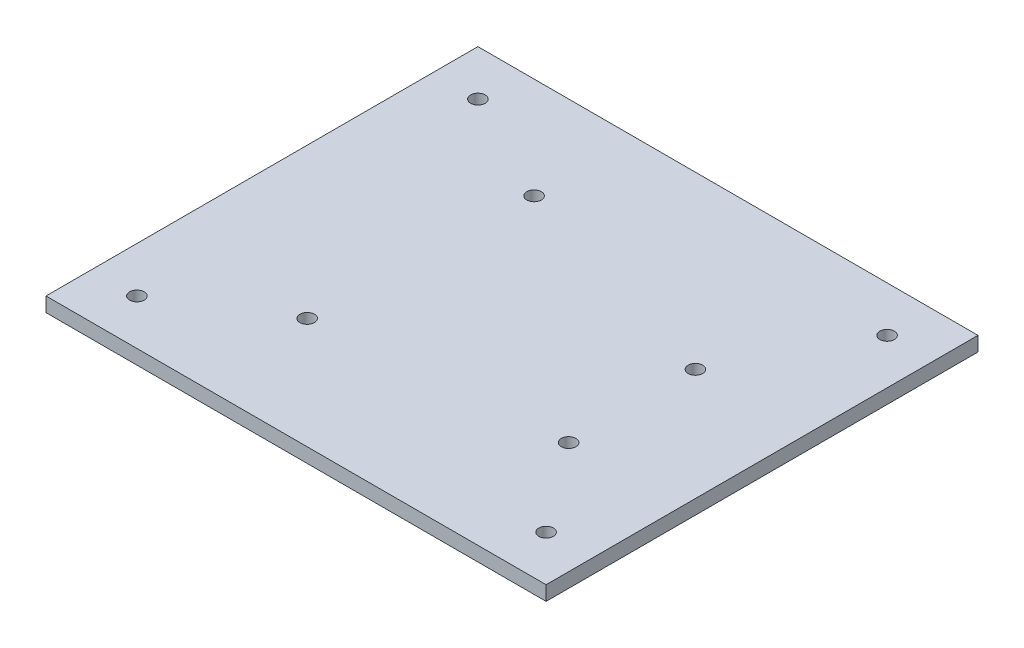
ISO-10303-21;
HEADER;
FILE_DESCRIPTION(('STEP AP214'),'2;1');
FILE_NAME('part.step','',(''),(''),'','','');
FILE_SCHEMA(('AUTOMOTIVE_DESIGN { 1 0 10303 214 1 1 1 1 }'));
ENDSEC;
DATA;
#1=APPLICATION_CONTEXT('core data for automotive mechanical design processes');
#2=APPLICATION_PROTOCOL_DEFINITION('international standard','automotive_design',2000,#1);
#3=PRODUCT_CONTEXT('',#1,'mechanical');
#4=PRODUCT('Part','Part','',(#3));
#5=PRODUCT_RELATED_PRODUCT_CATEGORY('part','',(#4));
#6=PRODUCT_DEFINITION_FORMATION('','',#4);
#7=PRODUCT_DEFINITION_CONTEXT('part definition',#1,'design');
#8=PRODUCT_DEFINITION('design','',#6,#7);
#9=PRODUCT_DEFINITION_SHAPE('','',#8);
#10=(LENGTH_UNIT() NAMED_UNIT(*) SI_UNIT(.MILLI.,.METRE.));
#11=(NAMED_UNIT(*) PLANE_ANGLE_UNIT() SI_UNIT($,.RADIAN.));
#12=(NAMED_UNIT(*) SI_UNIT($,.STERADIAN.) SOLID_ANGLE_UNIT());
#13=UNCERTAINTY_MEASURE_WITH_UNIT(LENGTH_MEASURE(1.E-05),#10,'distance_accuracy_value','');
#14=(GEOMETRIC_REPRESENTATION_CONTEXT(3) GLOBAL_UNCERTAINTY_ASSIGNED_CONTEXT((#13)) GLOBAL_UNIT_ASSIGNED_CONTEXT((#10,
#11,#12)) REPRESENTATION_CONTEXT('',''));
#15=CARTESIAN_POINT('',(0.,0.,0.));
#16=DIRECTION('',(0.,0.,1.));
#17=DIRECTION('',(1.,0.,0.));
#18=AXIS2_PLACEMENT_3D('',#15,#16,#17);
#19=CARTESIAN_POINT('',(0.,3.18,47.5));
#20=DIRECTION('',(0.,0.,-1.));
#21=DIRECTION('',(-1.,0.,0.));
#22=AXIS2_PLACEMENT_3D('',#19,#20,#21);
#23=PLANE('',#22);
#24=DIRECTION('',(1.,0.,0.));
#25=VECTOR('',#24,1.);
#26=CARTESIAN_POINT('',(0.,0.,47.5));
#27=LINE('',#26,#25);
#28=CARTESIAN_POINT('',(-55.,0.,47.5));
#29=VERTEX_POINT('',#28);
#30=CARTESIAN_POINT('',(55.,0.,47.5));
#31=VERTEX_POINT('',#30);
#32=EDGE_CURVE('E105',#29,#31,#27,.T.);
#33=ORIENTED_EDGE('',*,*,#32,.T.);
#34=DIRECTION('',(0.,-1.,0.));
#35=VECTOR('',#34,1.);
#36=CARTESIAN_POINT('',(55.,3.18,47.5));
#37=LINE('',#36,#35);
#38=CARTESIAN_POINT('',(55.,3.18,47.5));
#39=VERTEX_POINT('',#38);
#40=EDGE_CURVE('E11',#39,#31,#37,.T.);
#41=ORIENTED_EDGE('',*,*,#40,.F.);
#42=DIRECTION('',(1.,0.,0.));
#43=VECTOR('',#42,1.);
#44=CARTESIAN_POINT('',(0.,3.18,47.5));
#45=LINE('',#44,#43);
#46=CARTESIAN_POINT('',(-55.,3.18,47.5));
#47=VERTEX_POINT('',#46);
#48=EDGE_CURVE('E81',#47,#39,#45,.T.);
#49=ORIENTED_EDGE('',*,*,#48,.F.);
#50=DIRECTION('',(0.,-1.,0.));
#51=VECTOR('',#50,1.);
#52=CARTESIAN_POINT('',(-55.,3.18,47.5));
#53=LINE('',#52,#51);
#54=EDGE_CURVE('E101',#47,#29,#53,.T.);
#55=ORIENTED_EDGE('',*,*,#54,.T.);
#56=EDGE_LOOP('',(#33,#41,#49,#55));
#57=FACE_BOUND('',#56,.T.);
#58=ADVANCED_FACE('F40',(#57),#23,.F.);
#59=CARTESIAN_POINT('',(55.,3.18,0.));
#60=DIRECTION('',(1.,0.,0.));
#61=DIRECTION('',(0.,0.,-1.));
#62=AXIS2_PLACEMENT_3D('',#59,#60,#61);
#63=PLANE('',#62);
#64=DIRECTION('',(0.,0.,1.));
#65=VECTOR('',#64,1.);
#66=CARTESIAN_POINT('',(55.,0.,0.));
#67=LINE('',#66,#65);
#68=CARTESIAN_POINT('',(55.,0.,-47.5));
#69=VERTEX_POINT('',#68);
#70=EDGE_CURVE('E90',#69,#31,#67,.T.);
#71=ORIENTED_EDGE('',*,*,#70,.F.);
#72=DIRECTION('',(0.,-1.,0.));
#73=VECTOR('',#72,1.);
#74=CARTESIAN_POINT('',(55.,3.18,-47.5));
#75=LINE('',#74,#73);
#76=CARTESIAN_POINT('',(55.,3.18,-47.5));
#77=VERTEX_POINT('',#76);
#78=EDGE_CURVE('E49',#77,#69,#75,.T.);
#79=ORIENTED_EDGE('',*,*,#78,.F.);
#80=DIRECTION('',(0.,0.,1.));
#81=VECTOR('',#80,1.);
#82=CARTESIAN_POINT('',(55.,3.18,0.));
#83=LINE('',#82,#81);
#84=EDGE_CURVE('E88',#77,#39,#83,.T.);
#85=ORIENTED_EDGE('',*,*,#84,.T.);
#86=ORIENTED_EDGE('',*,*,#40,.T.);
#87=EDGE_LOOP('',(#71,#79,#85,#86));
#88=FACE_BOUND('',#87,.T.);
#89=ADVANCED_FACE('F87',(#88),#63,.T.);
#90=CARTESIAN_POINT('',(0.,3.18,-47.5));
#91=DIRECTION('',(0.,0.,-1.));
#92=DIRECTION('',(-1.,0.,0.));
#93=AXIS2_PLACEMENT_3D('',#90,#91,#92);
#94=PLANE('',#93);
#95=DIRECTION('',(1.,0.,0.));
#96=VECTOR('',#95,1.);
#97=CARTESIAN_POINT('',(0.,0.,-47.5));
#98=LINE('',#97,#96);
#99=CARTESIAN_POINT('',(-55.,0.,-47.5));
#100=VERTEX_POINT('',#99);
#101=EDGE_CURVE('E110',#100,#69,#98,.T.);
#102=ORIENTED_EDGE('',*,*,#101,.F.);
#103=DIRECTION('',(0.,-1.,0.));
#104=VECTOR('',#103,1.);
#105=CARTESIAN_POINT('',(-55.,3.18,-47.5));
#106=LINE('',#105,#104);
#107=CARTESIAN_POINT('',(-55.,3.18,-47.5));
#108=VERTEX_POINT('',#107);
#109=EDGE_CURVE('E73',#108,#100,#106,.T.);
#110=ORIENTED_EDGE('',*,*,#109,.F.);
#111=DIRECTION('',(1.,0.,0.));
#112=VECTOR('',#111,1.);
#113=CARTESIAN_POINT('',(0.,3.18,-47.5));
#114=LINE('',#113,#112);
#115=EDGE_CURVE('E97',#108,#77,#114,.T.);
#116=ORIENTED_EDGE('',*,*,#115,.T.);
#117=ORIENTED_EDGE('',*,*,#78,.T.);
#118=EDGE_LOOP('',(#102,#110,#116,#117));
#119=FACE_BOUND('',#118,.T.);
#120=ADVANCED_FACE('F99',(#119),#94,.T.);
#121=CARTESIAN_POINT('',(-55.,3.18,0.));
#122=DIRECTION('',(1.,0.,0.));
#123=DIRECTION('',(0.,0.,-1.));
#124=AXIS2_PLACEMENT_3D('',#121,#122,#123);
#125=PLANE('',#124);
#126=DIRECTION('',(0.,0.,1.));
#127=VECTOR('',#126,1.);
#128=CARTESIAN_POINT('',(-55.,0.,0.));
#129=LINE('',#128,#127);
#130=EDGE_CURVE('E76',#100,#29,#129,.T.);
#131=ORIENTED_EDGE('',*,*,#130,.T.);
#132=ORIENTED_EDGE('',*,*,#54,.F.);
#133=DIRECTION('',(0.,0.,1.));
#134=VECTOR('',#133,1.);
#135=CARTESIAN_POINT('',(-55.,3.18,0.));
#136=LINE('',#135,#134);
#137=EDGE_CURVE('E58',#108,#47,#136,.T.);
#138=ORIENTED_EDGE('',*,*,#137,.F.);
#139=ORIENTED_EDGE('',*,*,#109,.T.);
#140=EDGE_LOOP('',(#131,#132,#138,#139));
#141=FACE_BOUND('',#140,.T.);
#142=ADVANCED_FACE('F172',(#141),#125,.F.);
#143=CARTESIAN_POINT('',(0.,3.18,0.));
#144=DIRECTION('',(0.,1.,0.));
#145=DIRECTION('',(0.,0.,1.));
#146=AXIS2_PLACEMENT_3D('',#143,#144,#145);
#147=PLANE('',#146);
#148=CARTESIAN_POINT('',(45.,3.18,37.5));
#149=DIRECTION('',(0.,1.,0.));
#150=DIRECTION('',(0.,0.,1.));
#151=AXIS2_PLACEMENT_3D('',#148,#149,#150);
#152=CIRCLE('',#151,1.6);
#153=CARTESIAN_POINT('',(45.,3.18,39.1));
#154=VERTEX_POINT('',#153);
#155=EDGE_CURVE('E156',#154,#154,#152,.T.);
#156=ORIENTED_EDGE('',*,*,#155,.F.);
#157=EDGE_LOOP('',(#156));
#158=FACE_BOUND('',#157,.T.);
#159=CARTESIAN_POINT('',(-45.,3.18,-37.5));
#160=DIRECTION('',(0.,1.,0.));
#161=DIRECTION('',(0.,0.,1.));
#162=AXIS2_PLACEMENT_3D('',#159,#160,#161);
#163=CIRCLE('',#162,1.6);
#164=CARTESIAN_POINT('',(-45.,3.18,-35.9));
#165=VERTEX_POINT('',#164);
#166=EDGE_CURVE('E157',#165,#165,#163,.T.);
#167=ORIENTED_EDGE('',*,*,#166,.F.);
#168=EDGE_LOOP('',(#167));
#169=FACE_BOUND('',#168,.T.);
#170=CARTESIAN_POINT('',(-45.,3.18,37.5));
#171=DIRECTION('',(0.,1.,0.));
#172=DIRECTION('',(0.,0.,1.));
#173=AXIS2_PLACEMENT_3D('',#170,#171,#172);
#174=CIRCLE('',#173,1.6);
#175=CARTESIAN_POINT('',(-45.,3.18,39.1));
#176=VERTEX_POINT('',#175);
#177=EDGE_CURVE('E160',#176,#176,#174,.T.);
#178=ORIENTED_EDGE('',*,*,#177,.F.);
#179=EDGE_LOOP('',(#178));
#180=FACE_BOUND('',#179,.T.);
#181=CARTESIAN_POINT('',(45.,3.18,-37.5));
#182=DIRECTION('',(0.,1.,0.));
#183=DIRECTION('',(0.,0.,1.));
#184=AXIS2_PLACEMENT_3D('',#181,#182,#183);
#185=CIRCLE('',#184,1.6);
#186=CARTESIAN_POINT('',(45.,3.18,-35.9));
#187=VERTEX_POINT('',#186);
#188=EDGE_CURVE('E119',#187,#187,#185,.T.);
#189=ORIENTED_EDGE('',*,*,#188,.F.);
#190=EDGE_LOOP('',(#189));
#191=FACE_BOUND('',#190,.T.);
#192=CARTESIAN_POINT('',(-20.4,3.18,-25.25));
#193=DIRECTION('',(0.,1.,0.));
#194=DIRECTION('',(0.,0.,1.));
#195=AXIS2_PLACEMENT_3D('',#192,#193,#194);
#196=CIRCLE('',#195,1.6);
#197=CARTESIAN_POINT('',(-20.4,3.18,-23.65));
#198=VERTEX_POINT('',#197);
#199=EDGE_CURVE('E149',#198,#198,#196,.T.);
#200=ORIENTED_EDGE('',*,*,#199,.F.);
#201=EDGE_LOOP('',(#200));
#202=FACE_BOUND('',#201,.T.);
#203=CARTESIAN_POINT('',(30.4,3.18,-9.95000000000001));
#204=DIRECTION('',(0.,1.,0.));
#205=DIRECTION('',(0.,0.,1.));
#206=AXIS2_PLACEMENT_3D('',#203,#204,#205);
#207=CIRCLE('',#206,1.6);
#208=CARTESIAN_POINT('',(30.4,3.18,-8.35));
#209=VERTEX_POINT('',#208);
#210=EDGE_CURVE('E143',#209,#209,#207,.T.);
#211=ORIENTED_EDGE('',*,*,#210,.F.);
#212=EDGE_LOOP('',(#211));
#213=FACE_BOUND('',#212,.T.);
#214=CARTESIAN_POINT('',(30.4,3.18,17.95));
#215=DIRECTION('',(0.,1.,0.));
#216=DIRECTION('',(0.,0.,1.));
#217=AXIS2_PLACEMENT_3D('',#214,#215,#216);
#218=CIRCLE('',#217,1.6);
#219=CARTESIAN_POINT('',(30.4,3.18,19.55));
#220=VERTEX_POINT('',#219);
#221=EDGE_CURVE('E135',#220,#220,#218,.T.);
#222=ORIENTED_EDGE('',*,*,#221,.F.);
#223=EDGE_LOOP('',(#222));
#224=FACE_BOUND('',#223,.T.);
#225=CARTESIAN_POINT('',(-22.,3.18,23.05));
#226=DIRECTION('',(0.,1.,0.));
#227=DIRECTION('',(0.,0.,1.));
#228=AXIS2_PLACEMENT_3D('',#225,#226,#227);
#229=CIRCLE('',#228,1.6);
#230=CARTESIAN_POINT('',(-22.,3.18,24.65));
#231=VERTEX_POINT('',#230);
#232=EDGE_CURVE('E126',#231,#231,#229,.T.);
#233=ORIENTED_EDGE('',*,*,#232,.F.);
#234=EDGE_LOOP('',(#233));
#235=FACE_BOUND('',#234,.T.);
#236=ORIENTED_EDGE('',*,*,#48,.T.);
#237=ORIENTED_EDGE('',*,*,#84,.F.);
#238=ORIENTED_EDGE('',*,*,#115,.F.);
#239=ORIENTED_EDGE('',*,*,#137,.T.);
#240=EDGE_LOOP('',(#236,#237,#238,#239));
#241=FACE_BOUND('',#240,.T.);
#242=ADVANCED_FACE('F96',(#158,#169,#180,#191,#202,#213,#224,#235,#241),#147,.T.);
#243=CARTESIAN_POINT('',(0.,0.,0.));
#244=DIRECTION('',(0.,1.,0.));
#245=DIRECTION('',(0.,0.,1.));
#246=AXIS2_PLACEMENT_3D('',#243,#244,#245);
#247=PLANE('',#246);
#248=CARTESIAN_POINT('',(45.,0.,37.5));
#249=DIRECTION('',(0.,1.,0.));
#250=DIRECTION('',(0.,0.,1.));
#251=AXIS2_PLACEMENT_3D('',#248,#249,#250);
#252=CIRCLE('',#251,1.6);
#253=CARTESIAN_POINT('',(45.,0.,39.1));
#254=VERTEX_POINT('',#253);
#255=EDGE_CURVE('E43',#254,#254,#252,.T.);
#256=ORIENTED_EDGE('',*,*,#255,.T.);
#257=EDGE_LOOP('',(#256));
#258=FACE_BOUND('',#257,.T.);
#259=CARTESIAN_POINT('',(-45.,0.,-37.5));
#260=DIRECTION('',(0.,1.,0.));
#261=DIRECTION('',(0.,0.,1.));
#262=AXIS2_PLACEMENT_3D('',#259,#260,#261);
#263=CIRCLE('',#262,1.6);
#264=CARTESIAN_POINT('',(-45.,0.,-35.9));
#265=VERTEX_POINT('',#264);
#266=EDGE_CURVE('E121',#265,#265,#263,.T.);
#267=ORIENTED_EDGE('',*,*,#266,.T.);
#268=EDGE_LOOP('',(#267));
#269=FACE_BOUND('',#268,.T.);
#270=CARTESIAN_POINT('',(-45.,0.,37.5));
#271=DIRECTION('',(0.,1.,0.));
#272=DIRECTION('',(0.,0.,1.));
#273=AXIS2_PLACEMENT_3D('',#270,#271,#272);
#274=CIRCLE('',#273,1.6);
#275=CARTESIAN_POINT('',(-45.,0.,39.1));
#276=VERTEX_POINT('',#275);
#277=EDGE_CURVE('E118',#276,#276,#274,.T.);
#278=ORIENTED_EDGE('',*,*,#277,.T.);
#279=EDGE_LOOP('',(#278));
#280=FACE_BOUND('',#279,.T.);
#281=CARTESIAN_POINT('',(45.,0.,-37.5));
#282=DIRECTION('',(0.,1.,0.));
#283=DIRECTION('',(0.,0.,1.));
#284=AXIS2_PLACEMENT_3D('',#281,#282,#283);
#285=CIRCLE('',#284,1.6);
#286=CARTESIAN_POINT('',(45.,0.,-35.9));
#287=VERTEX_POINT('',#286);
#288=EDGE_CURVE('E115',#287,#287,#285,.T.);
#289=ORIENTED_EDGE('',*,*,#288,.T.);
#290=EDGE_LOOP('',(#289));
#291=FACE_BOUND('',#290,.T.);
#292=CARTESIAN_POINT('',(-20.4,0.,-25.25));
#293=DIRECTION('',(0.,1.,0.));
#294=DIRECTION('',(0.,0.,1.));
#295=AXIS2_PLACEMENT_3D('',#292,#293,#294);
#296=CIRCLE('',#295,1.6);
#297=CARTESIAN_POINT('',(-20.4,0.,-23.65));
#298=VERTEX_POINT('',#297);
#299=EDGE_CURVE('E108',#298,#298,#296,.T.);
#300=ORIENTED_EDGE('',*,*,#299,.T.);
#301=EDGE_LOOP('',(#300));
#302=FACE_BOUND('',#301,.T.);
#303=CARTESIAN_POINT('',(30.4,0.,-9.95000000000001));
#304=DIRECTION('',(0.,1.,0.));
#305=DIRECTION('',(0.,0.,1.));
#306=AXIS2_PLACEMENT_3D('',#303,#304,#305);
#307=CIRCLE('',#306,1.6);
#308=CARTESIAN_POINT('',(30.4,0.,-8.35));
#309=VERTEX_POINT('',#308);
#310=EDGE_CURVE('E146',#309,#309,#307,.T.);
#311=ORIENTED_EDGE('',*,*,#310,.T.);
#312=EDGE_LOOP('',(#311));
#313=FACE_BOUND('',#312,.T.);
#314=CARTESIAN_POINT('',(30.4,0.,17.95));
#315=DIRECTION('',(0.,1.,0.));
#316=DIRECTION('',(0.,0.,1.));
#317=AXIS2_PLACEMENT_3D('',#314,#315,#316);
#318=CIRCLE('',#317,1.6);
#319=CARTESIAN_POINT('',(30.4,0.,19.55));
#320=VERTEX_POINT('',#319);
#321=EDGE_CURVE('E140',#320,#320,#318,.T.);
#322=ORIENTED_EDGE('',*,*,#321,.T.);
#323=EDGE_LOOP('',(#322));
#324=FACE_BOUND('',#323,.T.);
#325=CARTESIAN_POINT('',(-22.,0.,23.05));
#326=DIRECTION('',(0.,1.,0.));
#327=DIRECTION('',(0.,0.,1.));
#328=AXIS2_PLACEMENT_3D('',#325,#326,#327);
#329=CIRCLE('',#328,1.6);
#330=CARTESIAN_POINT('',(-22.,0.,24.65));
#331=VERTEX_POINT('',#330);
#332=EDGE_CURVE('E130',#331,#331,#329,.T.);
#333=ORIENTED_EDGE('',*,*,#332,.T.);
#334=EDGE_LOOP('',(#333));
#335=FACE_BOUND('',#334,.T.);
#336=ORIENTED_EDGE('',*,*,#32,.F.);
#337=ORIENTED_EDGE('',*,*,#130,.F.);
#338=ORIENTED_EDGE('',*,*,#101,.T.);
#339=ORIENTED_EDGE('',*,*,#70,.T.);
#340=EDGE_LOOP('',(#336,#337,#338,#339));
#341=FACE_BOUND('',#340,.T.);
#342=ADVANCED_FACE('F171',(#258,#269,#280,#291,#302,#313,#324,#335,#341),#247,.F.);
#343=CARTESIAN_POINT('',(-22.,0.,23.05));
#344=DIRECTION('',(0.,1.,0.));
#345=DIRECTION('',(0.,0.,1.));
#346=AXIS2_PLACEMENT_3D('',#343,#344,#345);
#347=CYLINDRICAL_SURFACE('',#346,1.6);
#348=ORIENTED_EDGE('',*,*,#332,.F.);
#349=EDGE_LOOP('',(#348));
#350=FACE_BOUND('',#349,.T.);
#351=ORIENTED_EDGE('',*,*,#232,.T.);
#352=EDGE_LOOP('',(#351));
#353=FACE_BOUND('',#352,.T.);
#354=ADVANCED_FACE('F187',(#350,#353),#347,.F.);
#355=CARTESIAN_POINT('',(30.4,0.,17.95));
#356=DIRECTION('',(0.,1.,0.));
#357=DIRECTION('',(0.,0.,1.));
#358=AXIS2_PLACEMENT_3D('',#355,#356,#357);
#359=CYLINDRICAL_SURFACE('',#358,1.6);
#360=ORIENTED_EDGE('',*,*,#321,.F.);
#361=EDGE_LOOP('',(#360));
#362=FACE_BOUND('',#361,.T.);
#363=ORIENTED_EDGE('',*,*,#221,.T.);
#364=EDGE_LOOP('',(#363));
#365=FACE_BOUND('',#364,.T.);
#366=ADVANCED_FACE('F184',(#362,#365),#359,.F.);
#367=CARTESIAN_POINT('',(30.4,0.,-9.95000000000001));
#368=DIRECTION('',(0.,1.,0.));
#369=DIRECTION('',(0.,0.,1.));
#370=AXIS2_PLACEMENT_3D('',#367,#368,#369);
#371=CYLINDRICAL_SURFACE('',#370,1.6);
#372=ORIENTED_EDGE('',*,*,#310,.F.);
#373=EDGE_LOOP('',(#372));
#374=FACE_BOUND('',#373,.T.);
#375=ORIENTED_EDGE('',*,*,#210,.T.);
#376=EDGE_LOOP('',(#375));
#377=FACE_BOUND('',#376,.T.);
#378=ADVANCED_FACE('F186',(#374,#377),#371,.F.);
#379=CARTESIAN_POINT('',(-20.4,0.,-25.25));
#380=DIRECTION('',(0.,1.,0.));
#381=DIRECTION('',(0.,0.,1.));
#382=AXIS2_PLACEMENT_3D('',#379,#380,#381);
#383=CYLINDRICAL_SURFACE('',#382,1.6);
#384=ORIENTED_EDGE('',*,*,#299,.F.);
#385=EDGE_LOOP('',(#384));
#386=FACE_BOUND('',#385,.T.);
#387=ORIENTED_EDGE('',*,*,#199,.T.);
#388=EDGE_LOOP('',(#387));
#389=FACE_BOUND('',#388,.T.);
#390=ADVANCED_FACE('F194',(#386,#389),#383,.F.);
#391=CARTESIAN_POINT('',(45.,-6.82,-37.5));
#392=DIRECTION('',(0.,1.,0.));
#393=DIRECTION('',(0.,0.,1.));
#394=AXIS2_PLACEMENT_3D('',#391,#392,#393);
#395=CYLINDRICAL_SURFACE('',#394,1.6);
#396=ORIENTED_EDGE('',*,*,#188,.T.);
#397=EDGE_LOOP('',(#396));
#398=FACE_BOUND('',#397,.T.);
#399=ORIENTED_EDGE('',*,*,#288,.F.);
#400=EDGE_LOOP('',(#399));
#401=FACE_BOUND('',#400,.T.);
#402=ADVANCED_FACE('F259',(#398,#401),#395,.F.);
#403=CARTESIAN_POINT('',(-45.,-6.82,37.5));
#404=DIRECTION('',(0.,1.,0.));
#405=DIRECTION('',(0.,0.,1.));
#406=AXIS2_PLACEMENT_3D('',#403,#404,#405);
#407=CYLINDRICAL_SURFACE('',#406,1.6);
#408=ORIENTED_EDGE('',*,*,#177,.T.);
#409=EDGE_LOOP('',(#408));
#410=FACE_BOUND('',#409,.T.);
#411=ORIENTED_EDGE('',*,*,#277,.F.);
#412=EDGE_LOOP('',(#411));
#413=FACE_BOUND('',#412,.T.);
#414=ADVANCED_FACE('F166',(#410,#413),#407,.F.);
#415=CARTESIAN_POINT('',(-45.,-6.82,-37.5));
#416=DIRECTION('',(0.,1.,0.));
#417=DIRECTION('',(0.,0.,1.));
#418=AXIS2_PLACEMENT_3D('',#415,#416,#417);
#419=CYLINDRICAL_SURFACE('',#418,1.6);
#420=ORIENTED_EDGE('',*,*,#166,.T.);
#421=EDGE_LOOP('',(#420));
#422=FACE_BOUND('',#421,.T.);
#423=ORIENTED_EDGE('',*,*,#266,.F.);
#424=EDGE_LOOP('',(#423));
#425=FACE_BOUND('',#424,.T.);
#426=ADVANCED_FACE('F275',(#422,#425),#419,.F.);
#427=CARTESIAN_POINT('',(45.,-6.82,37.5));
#428=DIRECTION('',(0.,1.,0.));
#429=DIRECTION('',(0.,0.,1.));
#430=AXIS2_PLACEMENT_3D('',#427,#428,#429);
#431=CYLINDRICAL_SURFACE('',#430,1.6);
#432=ORIENTED_EDGE('',*,*,#155,.T.);
#433=EDGE_LOOP('',(#432));
#434=FACE_BOUND('',#433,.T.);
#435=ORIENTED_EDGE('',*,*,#255,.F.);
#436=EDGE_LOOP('',(#435));
#437=FACE_BOUND('',#436,.T.);
#438=ADVANCED_FACE('F282',(#434,#437),#431,.F.);
#439=CLOSED_SHELL('',(#58,#89,#120,#142,#242,#342,#354,#366,#378,#390,#402,#414,#426,#438));
#440=MANIFOLD_SOLID_BREP('B2',#439);
#441=ADVANCED_BREP_SHAPE_REPRESENTATION('',(#18,#440),#14);
#442=SHAPE_DEFINITION_REPRESENTATION(#9,#441);
ENDSEC;
END-ISO-10303-21;
